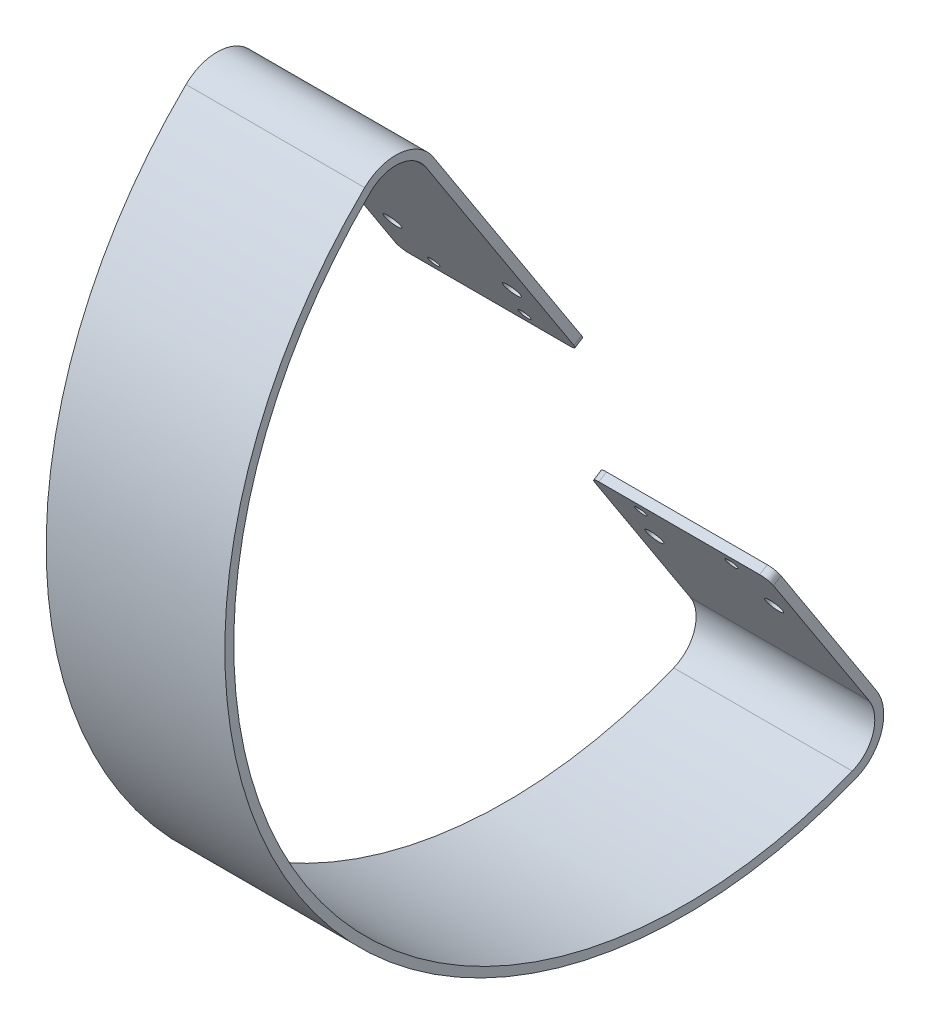
ISO-10303-21;
HEADER;
FILE_DESCRIPTION(('STEP AP214'),'2;1');
FILE_NAME('part.step','',(''),(''),'','','');
FILE_SCHEMA(('AUTOMOTIVE_DESIGN { 1 0 10303 214 1 1 1 1 }'));
ENDSEC;
DATA;
#1=APPLICATION_CONTEXT('core data for automotive mechanical design processes');
#2=APPLICATION_PROTOCOL_DEFINITION('international standard','automotive_design',2000,#1);
#3=PRODUCT_CONTEXT('',#1,'mechanical');
#4=PRODUCT('Part','Part','',(#3));
#5=PRODUCT_RELATED_PRODUCT_CATEGORY('part','',(#4));
#6=PRODUCT_DEFINITION_FORMATION('','',#4);
#7=PRODUCT_DEFINITION_CONTEXT('part definition',#1,'design');
#8=PRODUCT_DEFINITION('design','',#6,#7);
#9=PRODUCT_DEFINITION_SHAPE('','',#8);
#10=(LENGTH_UNIT() NAMED_UNIT(*) SI_UNIT(.MILLI.,.METRE.));
#11=(NAMED_UNIT(*) PLANE_ANGLE_UNIT() SI_UNIT($,.RADIAN.));
#12=(NAMED_UNIT(*) SI_UNIT($,.STERADIAN.) SOLID_ANGLE_UNIT());
#13=UNCERTAINTY_MEASURE_WITH_UNIT(LENGTH_MEASURE(1.E-05),#10,'distance_accuracy_value','');
#14=(GEOMETRIC_REPRESENTATION_CONTEXT(3) GLOBAL_UNCERTAINTY_ASSIGNED_CONTEXT((#13)) GLOBAL_UNIT_ASSIGNED_CONTEXT((#10,
#11,#12)) REPRESENTATION_CONTEXT('',''));
#15=CARTESIAN_POINT('',(0.,0.,0.));
#16=DIRECTION('',(0.,0.,1.));
#17=DIRECTION('',(1.,0.,0.));
#18=AXIS2_PLACEMENT_3D('',#15,#16,#17);
#19=CARTESIAN_POINT('',(2006.6,149.886108079532,-218.334745744563));
#20=DIRECTION('',(0.,0.543974891923004,-0.839101493835732));
#21=DIRECTION('',(0.,0.839101493835732,0.543974891923004));
#22=AXIS2_PLACEMENT_3D('',#19,#20,#21);
#23=PLANE('',#22);
#24=CARTESIAN_POINT('',(1967.84011050403,153.665323041059,-215.884746471111));
#25=DIRECTION('',(0.,0.543974891923004,-0.839101493835732));
#26=DIRECTION('',(1.,3.48262757274063E-13,2.25772683210182E-13));
#27=AXIS2_PLACEMENT_3D('',#24,#25,#26);
#28=ELLIPSE('',#27,1.5506422952547,1.55064227634246);
#29=CARTESIAN_POINT('',(1969.39075279928,153.665323041059,-215.884746471111));
#30=VERTEX_POINT('',#29);
#31=EDGE_CURVE('E202',#30,#30,#28,.T.);
#32=ORIENTED_EDGE('',*,*,#31,.T.);
#33=EDGE_LOOP('',(#32));
#34=FACE_BOUND('',#33,.T.);
#35=CARTESIAN_POINT('',(1997.90586178967,165.762560149689,-208.042318234388));
#36=DIRECTION('',(0.,0.543974891923004,-0.839101493835732));
#37=DIRECTION('',(1.,3.55764608070903E-13,2.30636002494456E-13));
#38=AXIS2_PLACEMENT_3D('',#35,#36,#37);
#39=ELLIPSE('',#38,2.38125000000022,2.38124997095735);
#40=CARTESIAN_POINT('',(2000.28711178967,165.762560149689,-208.042318234388));
#41=VERTEX_POINT('',#40);
#42=EDGE_CURVE('E478',#41,#41,#39,.T.);
#43=ORIENTED_EDGE('',*,*,#42,.T.);
#44=EDGE_LOOP('',(#43));
#45=FACE_BOUND('',#44,.T.);
#46=CARTESIAN_POINT('',(1963.90586178987,165.7624622721,-208.042381686725));
#47=DIRECTION('',(0.,0.543974891923004,-0.839101493835732));
#48=DIRECTION('',(1.,3.55764608070937E-13,2.30636002494477E-13));
#49=AXIS2_PLACEMENT_3D('',#46,#47,#48);
#50=ELLIPSE('',#49,2.38125,2.38124997095734);
#51=CARTESIAN_POINT('',(1966.28711178987,165.762462272101,-208.042381686724));
#52=VERTEX_POINT('',#51);
#53=EDGE_CURVE('E473',#52,#52,#50,.T.);
#54=ORIENTED_EDGE('',*,*,#53,.T.);
#55=EDGE_LOOP('',(#54));
#56=FACE_BOUND('',#55,.T.);
#57=CARTESIAN_POINT('',(1993.65591952053,153.665397358386,-215.884698292482));
#58=DIRECTION('',(0.,0.543974891923004,-0.839101493835732));
#59=DIRECTION('',(1.,3.54582697176244E-13,2.29869790235381E-13));
#60=AXIS2_PLACEMENT_3D('',#57,#58,#59);
#61=ELLIPSE('',#60,1.64615825234016,1.64615823226305);
#62=CARTESIAN_POINT('',(1995.30207777287,153.665397358386,-215.884698292481));
#63=VERTEX_POINT('',#62);
#64=EDGE_CURVE('E469',#63,#63,#61,.T.);
#65=ORIENTED_EDGE('',*,*,#64,.T.);
#66=EDGE_LOOP('',(#65));
#67=FACE_BOUND('',#66,.T.);
#68=DIRECTION('',(-1.,0.,0.));
#69=VECTOR('',#68,1.);
#70=CARTESIAN_POINT('',(2006.6,149.886108079532,-218.334745744563));
#71=LINE('',#70,#69);
#72=CARTESIAN_POINT('',(2004.06,149.886108079532,-218.334745744563));
#73=VERTEX_POINT('',#72);
#74=CARTESIAN_POINT('',(1958.34,149.886108079532,-218.334745744563));
#75=VERTEX_POINT('',#74);
#76=EDGE_CURVE('E247',#73,#75,#71,.T.);
#77=ORIENTED_EDGE('',*,*,#76,.F.);
#78=CARTESIAN_POINT('',(2004.06,152.017425873875,-216.953049519079));
#79=DIRECTION('',(0.,0.543974891923004,-0.839101493835732));
#80=DIRECTION('',(0.,0.839101493835732,0.543974891923004));
#81=AXIS2_PLACEMENT_3D('',#78,#79,#80);
#82=CIRCLE('',#81,2.54);
#83=CARTESIAN_POINT('',(2006.6,152.017425873875,-216.953049519079));
#84=VERTEX_POINT('',#83);
#85=EDGE_CURVE('E64',#73,#84,#82,.F.);
#86=ORIENTED_EDGE('',*,*,#85,.T.);
#87=DIRECTION('',(0.,-0.839101493835732,-0.543974891923004));
#88=VECTOR('',#87,1.);
#89=CARTESIAN_POINT('',(2006.6,149.886108079532,-218.334745744563));
#90=LINE('',#89,#88);
#91=CARTESIAN_POINT('',(2006.6,217.012893904773,-174.8176189933));
#92=VERTEX_POINT('',#91);
#93=EDGE_CURVE('E178',#92,#84,#90,.T.);
#94=ORIENTED_EDGE('',*,*,#93,.F.);
#95=DIRECTION('',(-1.,0.,0.));
#96=VECTOR('',#95,1.);
#97=CARTESIAN_POINT('',(2006.6,217.012893904773,-174.8176189933));
#98=LINE('',#97,#96);
#99=CARTESIAN_POINT('',(1955.8,217.012893904773,-174.8176189933));
#100=VERTEX_POINT('',#99);
#101=EDGE_CURVE('E199',#92,#100,#98,.T.);
#102=ORIENTED_EDGE('',*,*,#101,.T.);
#103=DIRECTION('',(0.,-0.839101493835732,-0.543974891923004));
#104=VECTOR('',#103,1.);
#105=CARTESIAN_POINT('',(1955.8,149.886108079532,-218.334745744563));
#106=LINE('',#105,#104);
#107=CARTESIAN_POINT('',(1955.8,152.017425873875,-216.953049519079));
#108=VERTEX_POINT('',#107);
#109=EDGE_CURVE('E200',#100,#108,#106,.T.);
#110=ORIENTED_EDGE('',*,*,#109,.T.);
#111=CARTESIAN_POINT('',(1958.34,152.017425873875,-216.953049519079));
#112=DIRECTION('',(0.,0.543974891923004,-0.839101493835732));
#113=DIRECTION('',(0.,0.839101493835732,0.543974891923004));
#114=AXIS2_PLACEMENT_3D('',#111,#112,#113);
#115=CIRCLE('',#114,2.54);
#116=EDGE_CURVE('E56',#108,#75,#115,.F.);
#117=ORIENTED_EDGE('',*,*,#116,.T.);
#118=EDGE_LOOP('',(#77,#86,#94,#102,#110,#117));
#119=FACE_BOUND('',#118,.T.);
#120=ADVANCED_FACE('F41',(#34,#45,#56,#67,#119),#23,.F.);
#121=CARTESIAN_POINT('',(2006.6,151.267804305016,-220.466063538906));
#122=DIRECTION('',(0.,-0.839101493835732,-0.543974891923003));
#123=DIRECTION('',(0.,0.543974891923004,-0.839101493835732));
#124=AXIS2_PLACEMENT_3D('',#121,#122,#123);
#125=PLANE('',#124);
#126=DIRECTION('',(-1.,0.,0.));
#127=VECTOR('',#126,1.);
#128=CARTESIAN_POINT('',(2006.6,151.267804305016,-220.466063538906));
#129=LINE('',#128,#127);
#130=CARTESIAN_POINT('',(2004.06,151.267804305016,-220.466063538906));
#131=VERTEX_POINT('',#130);
#132=CARTESIAN_POINT('',(1958.34,151.267804305016,-220.466063538906));
#133=VERTEX_POINT('',#132);
#134=EDGE_CURVE('E166',#131,#133,#129,.T.);
#135=ORIENTED_EDGE('',*,*,#134,.F.);
#136=DIRECTION('',(0.,-0.543974891923004,0.839101493835732));
#137=VECTOR('',#136,1.);
#138=CARTESIAN_POINT('',(2004.06,149.886108079532,-218.334745744563));
#139=LINE('',#138,#137);
#140=EDGE_CURVE('E273',#131,#73,#139,.T.);
#141=ORIENTED_EDGE('',*,*,#140,.T.);
#142=ORIENTED_EDGE('',*,*,#76,.T.);
#143=DIRECTION('',(0.,-0.543974891923004,0.839101493835732));
#144=VECTOR('',#143,1.);
#145=CARTESIAN_POINT('',(1958.34,151.267804305016,-220.466063538906));
#146=LINE('',#145,#144);
#147=EDGE_CURVE('E271',#75,#133,#146,.F.);
#148=ORIENTED_EDGE('',*,*,#147,.T.);
#149=EDGE_LOOP('',(#135,#141,#142,#148));
#150=FACE_BOUND('',#149,.T.);
#151=ADVANCED_FACE('F286',(#150),#125,.T.);
#152=CARTESIAN_POINT('',(2006.6,151.267804305016,-220.466063538906));
#153=DIRECTION('',(0.,0.543974891923003,-0.839101493835732));
#154=DIRECTION('',(0.,0.839101493835732,0.543974891923004));
#155=AXIS2_PLACEMENT_3D('',#152,#153,#154);
#156=PLANE('',#155);
#157=CARTESIAN_POINT('',(1967.84011050403,155.047019266543,-218.016064265454));
#158=DIRECTION('',(0.,0.543974891923004,-0.839101493835732));
#159=DIRECTION('',(1.,3.48262757274063E-13,2.25772683210182E-13));
#160=AXIS2_PLACEMENT_3D('',#157,#158,#159);
#161=ELLIPSE('',#160,1.5506422952547,1.55064227634246);
#162=CARTESIAN_POINT('',(1969.39075279928,155.047019266544,-218.016064265454));
#163=VERTEX_POINT('',#162);
#164=EDGE_CURVE('E374',#163,#163,#161,.T.);
#165=ORIENTED_EDGE('',*,*,#164,.F.);
#166=EDGE_LOOP('',(#165));
#167=FACE_BOUND('',#166,.T.);
#168=CARTESIAN_POINT('',(1997.90586178967,167.144256375173,-210.173636028731));
#169=DIRECTION('',(0.,0.543974891923004,-0.839101493835732));
#170=DIRECTION('',(1.,3.55764608070903E-13,2.30636002494456E-13));
#171=AXIS2_PLACEMENT_3D('',#168,#169,#170);
#172=ELLIPSE('',#171,2.38125000000022,2.38124997095735);
#173=CARTESIAN_POINT('',(2000.28711178967,167.144256375174,-210.17363602873));
#174=VERTEX_POINT('',#173);
#175=EDGE_CURVE('E378',#174,#174,#172,.T.);
#176=ORIENTED_EDGE('',*,*,#175,.F.);
#177=EDGE_LOOP('',(#176));
#178=FACE_BOUND('',#177,.T.);
#179=CARTESIAN_POINT('',(1963.90586178987,167.144158497585,-210.173699481068));
#180=DIRECTION('',(0.,0.543974891923004,-0.839101493835732));
#181=DIRECTION('',(1.,3.55764608070937E-13,2.30636002494477E-13));
#182=AXIS2_PLACEMENT_3D('',#179,#180,#181);
#183=ELLIPSE('',#182,2.38125,2.38124997095734);
#184=CARTESIAN_POINT('',(1966.28711178987,167.144158497585,-210.173699481067));
#185=VERTEX_POINT('',#184);
#186=EDGE_CURVE('E382',#185,#185,#183,.T.);
#187=ORIENTED_EDGE('',*,*,#186,.F.);
#188=EDGE_LOOP('',(#187));
#189=FACE_BOUND('',#188,.T.);
#190=CARTESIAN_POINT('',(1993.65591952053,155.04709358387,-218.016016086824));
#191=DIRECTION('',(0.,0.543974891923004,-0.839101493835732));
#192=DIRECTION('',(1.,3.54582697176244E-13,2.29869790235381E-13));
#193=AXIS2_PLACEMENT_3D('',#190,#191,#192);
#194=ELLIPSE('',#193,1.64615825234016,1.64615823226305);
#195=CARTESIAN_POINT('',(1995.30207777287,155.047093583871,-218.016016086824));
#196=VERTEX_POINT('',#195);
#197=EDGE_CURVE('E385',#196,#196,#194,.T.);
#198=ORIENTED_EDGE('',*,*,#197,.F.);
#199=EDGE_LOOP('',(#198));
#200=FACE_BOUND('',#199,.T.);
#201=DIRECTION('',(0.,-0.839101493835732,-0.543974891923004));
#202=VECTOR('',#201,1.);
#203=CARTESIAN_POINT('',(2006.6,151.267804305016,-220.466063538906));
#204=LINE('',#203,#202);
#205=CARTESIAN_POINT('',(2006.6,218.394590130257,-176.948936787643));
#206=VERTEX_POINT('',#205);
#207=CARTESIAN_POINT('',(2006.6,153.399122099359,-219.084367313422));
#208=VERTEX_POINT('',#207);
#209=EDGE_CURVE('E158',#206,#208,#204,.T.);
#210=ORIENTED_EDGE('',*,*,#209,.T.);
#211=CARTESIAN_POINT('',(2004.06,153.399122099359,-219.084367313422));
#212=DIRECTION('',(0.,0.543974891923003,-0.839101493835732));
#213=DIRECTION('',(0.,0.839101493835732,0.543974891923004));
#214=AXIS2_PLACEMENT_3D('',#211,#212,#213);
#215=CIRCLE('',#214,2.54);
#216=EDGE_CURVE('E11',#208,#131,#215,.T.);
#217=ORIENTED_EDGE('',*,*,#216,.T.);
#218=ORIENTED_EDGE('',*,*,#134,.T.);
#219=CARTESIAN_POINT('',(1958.34,153.399122099359,-219.084367313422));
#220=DIRECTION('',(0.,0.543974891923003,-0.839101493835732));
#221=DIRECTION('',(0.,0.839101493835732,0.543974891923004));
#222=AXIS2_PLACEMENT_3D('',#219,#220,#221);
#223=CIRCLE('',#222,2.54);
#224=CARTESIAN_POINT('',(1955.8,153.399122099359,-219.084367313422));
#225=VERTEX_POINT('',#224);
#226=EDGE_CURVE('E49',#133,#225,#223,.T.);
#227=ORIENTED_EDGE('',*,*,#226,.T.);
#228=DIRECTION('',(0.,-0.839101493835732,-0.543974891923004));
#229=VECTOR('',#228,1.);
#230=CARTESIAN_POINT('',(1955.8,151.267804305016,-220.466063538906));
#231=LINE('',#230,#229);
#232=CARTESIAN_POINT('',(1955.8,218.394590130257,-176.948936787643));
#233=VERTEX_POINT('',#232);
#234=EDGE_CURVE('E161',#233,#225,#231,.T.);
#235=ORIENTED_EDGE('',*,*,#234,.F.);
#236=DIRECTION('',(-1.,0.,0.));
#237=VECTOR('',#236,1.);
#238=CARTESIAN_POINT('',(2006.6,218.394590130257,-176.948936787643));
#239=LINE('',#238,#237);
#240=EDGE_CURVE('E155',#206,#233,#239,.T.);
#241=ORIENTED_EDGE('',*,*,#240,.F.);
#242=EDGE_LOOP('',(#210,#217,#218,#227,#235,#241));
#243=FACE_BOUND('',#242,.T.);
#244=ADVANCED_FACE('F157',(#167,#178,#189,#200,#243),#156,.T.);
#245=CARTESIAN_POINT('',(2006.6,211.486109002835,-166.292347815929));
#246=DIRECTION('',(-1.,0.,0.));
#247=DIRECTION('',(0.,0.,1.));
#248=AXIS2_PLACEMENT_3D('',#245,#246,#247);
#249=CYLINDRICAL_SURFACE('',#248,12.7);
#250=CARTESIAN_POINT('',(1955.8,211.486109002835,-166.292347815929));
#251=DIRECTION('',(-1.,0.,0.));
#252=DIRECTION('',(0.,0.,-1.));
#253=AXIS2_PLACEMENT_3D('',#250,#251,#252);
#254=CIRCLE('',#253,12.7);
#255=CARTESIAN_POINT('',(1955.8,220.604709470289,-157.452600901286));
#256=VERTEX_POINT('',#255);
#257=EDGE_CURVE('E204',#256,#233,#254,.T.);
#258=ORIENTED_EDGE('',*,*,#257,.F.);
#259=DIRECTION('',(-1.,0.,0.));
#260=VECTOR('',#259,1.);
#261=CARTESIAN_POINT('',(2006.6,220.604709470289,-157.452600901286));
#262=LINE('',#261,#260);
#263=CARTESIAN_POINT('',(2006.6,220.604709470289,-157.452600901286));
#264=VERTEX_POINT('',#263);
#265=EDGE_CURVE('E167',#264,#256,#262,.T.);
#266=ORIENTED_EDGE('',*,*,#265,.F.);
#267=CARTESIAN_POINT('',(2006.6,211.486109002835,-166.292347815929));
#268=DIRECTION('',(-1.,0.,0.));
#269=DIRECTION('',(0.,0.,-1.));
#270=AXIS2_PLACEMENT_3D('',#267,#268,#269);
#271=CIRCLE('',#270,12.7);
#272=EDGE_CURVE('E174',#264,#206,#271,.T.);
#273=ORIENTED_EDGE('',*,*,#272,.T.);
#274=ORIENTED_EDGE('',*,*,#240,.T.);
#275=EDGE_LOOP('',(#258,#266,#273,#274));
#276=FACE_BOUND('',#275,.T.);
#277=ADVANCED_FACE('F180',(#276),#249,.T.);
#278=CARTESIAN_POINT('',(2006.6,126.694324041268,-248.49113722186));
#279=DIRECTION('',(-1.,0.,0.));
#280=DIRECTION('',(0.,0.,1.));
#281=AXIS2_PLACEMENT_3D('',#278,#279,#280);
#282=CYLINDRICAL_SURFACE('',#281,130.794401970496);
#283=CARTESIAN_POINT('',(1955.8,126.694324041268,-248.49113722186));
#284=DIRECTION('',(-1.,0.,0.));
#285=DIRECTION('',(0.,0.,-1.));
#286=AXIS2_PLACEMENT_3D('',#283,#284,#285);
#287=CIRCLE('',#286,130.794401970496);
#288=CARTESIAN_POINT('',(1955.8,5.25262946196778,-297.061605662341));
#289=VERTEX_POINT('',#288);
#290=EDGE_CURVE('E206',#289,#256,#287,.T.);
#291=ORIENTED_EDGE('',*,*,#290,.F.);
#292=DIRECTION('',(-1.,0.,0.));
#293=VECTOR('',#292,1.);
#294=CARTESIAN_POINT('',(2006.6,5.25262946196778,-297.061605662341));
#295=LINE('',#294,#293);
#296=CARTESIAN_POINT('',(2006.6,5.25262946196778,-297.061605662341));
#297=VERTEX_POINT('',#296);
#298=EDGE_CURVE('E242',#297,#289,#295,.T.);
#299=ORIENTED_EDGE('',*,*,#298,.F.);
#300=CARTESIAN_POINT('',(2006.6,126.694324041268,-248.49113722186));
#301=DIRECTION('',(-1.,0.,0.));
#302=DIRECTION('',(0.,0.,-1.));
#303=AXIS2_PLACEMENT_3D('',#300,#301,#302);
#304=CIRCLE('',#303,130.794401970496);
#305=EDGE_CURVE('E181',#297,#264,#304,.T.);
#306=ORIENTED_EDGE('',*,*,#305,.T.);
#307=ORIENTED_EDGE('',*,*,#265,.T.);
#308=EDGE_LOOP('',(#291,#299,#306,#307));
#309=FACE_BOUND('',#308,.T.);
#310=ADVANCED_FACE('F356',(#309),#282,.T.);
#311=CARTESIAN_POINT('',(2006.6,17.0444913300699,-292.345463840512));
#312=DIRECTION('',(-1.,0.,0.));
#313=DIRECTION('',(0.,0.,1.));
#314=AXIS2_PLACEMENT_3D('',#311,#312,#313);
#315=CYLINDRICAL_SURFACE('',#314,12.7);
#316=CARTESIAN_POINT('',(1955.8,17.0444913300699,-292.345463840512));
#317=DIRECTION('',(-1.,0.,0.));
#318=DIRECTION('',(0.,0.,-1.));
#319=AXIS2_PLACEMENT_3D('',#316,#317,#318);
#320=CIRCLE('',#319,12.7);
#321=CARTESIAN_POINT('',(1955.8,23.9529724574921,-303.002052812226));
#322=VERTEX_POINT('',#321);
#323=EDGE_CURVE('E209',#322,#289,#320,.T.);
#324=ORIENTED_EDGE('',*,*,#323,.F.);
#325=DIRECTION('',(-1.,0.,0.));
#326=VECTOR('',#325,1.);
#327=CARTESIAN_POINT('',(2006.6,23.9529724574921,-303.002052812226));
#328=LINE('',#327,#326);
#329=CARTESIAN_POINT('',(2006.6,23.9529724574921,-303.002052812226));
#330=VERTEX_POINT('',#329);
#331=EDGE_CURVE('E239',#330,#322,#328,.T.);
#332=ORIENTED_EDGE('',*,*,#331,.F.);
#333=CARTESIAN_POINT('',(2006.6,17.0444913300699,-292.345463840512));
#334=DIRECTION('',(-1.,0.,0.));
#335=DIRECTION('',(0.,0.,-1.));
#336=AXIS2_PLACEMENT_3D('',#333,#334,#335);
#337=CIRCLE('',#336,12.7);
#338=EDGE_CURVE('E183',#330,#297,#337,.T.);
#339=ORIENTED_EDGE('',*,*,#338,.T.);
#340=ORIENTED_EDGE('',*,*,#298,.T.);
#341=EDGE_LOOP('',(#324,#332,#339,#340));
#342=FACE_BOUND('',#341,.T.);
#343=ADVANCED_FACE('F353',(#342),#315,.T.);
#344=CARTESIAN_POINT('',(2006.6,67.9873895182371,-274.455306754114));
#345=DIRECTION('',(0.,0.543974891923004,-0.839101493835731));
#346=DIRECTION('',(0.,0.839101493835732,0.543974891923004));
#347=AXIS2_PLACEMENT_3D('',#344,#345,#346);
#348=PLANE('',#347);
#349=CARTESIAN_POINT('',(1993.65629061313,64.2844925671254,-276.855830389908));
#350=DIRECTION('',(0.,0.543974891923004,-0.839101493835732));
#351=DIRECTION('',(-1.,-3.53698451048622E-13,-2.29296548863223E-13));
#352=AXIS2_PLACEMENT_3D('',#349,#350,#351);
#353=ELLIPSE('',#352,1.64615825234016,1.64615823226305);
#354=CARTESIAN_POINT('',(1992.01013236079,64.2844925671248,-276.855830389908));
#355=VERTEX_POINT('',#354);
#356=EDGE_CURVE('E388',#355,#355,#353,.T.);
#357=ORIENTED_EDGE('',*,*,#356,.F.);
#358=EDGE_LOOP('',(#357));
#359=FACE_BOUND('',#358,.T.);
#360=CARTESIAN_POINT('',(1963.90633180346,52.1872552448253,-284.69825876515));
#361=DIRECTION('',(0.,0.543974891923004,-0.839101493835732));
#362=DIRECTION('',(1.,3.56987166861558E-13,2.31428566076933E-13));
#363=AXIS2_PLACEMENT_3D('',#360,#361,#362);
#364=ELLIPSE('',#363,2.38125,2.38124997095734);
#365=CARTESIAN_POINT('',(1966.28758180346,52.1872552448262,-284.698258765149));
#366=VERTEX_POINT('',#365);
#367=EDGE_CURVE('E428',#366,#366,#364,.T.);
#368=ORIENTED_EDGE('',*,*,#367,.F.);
#369=EDGE_LOOP('',(#368));
#370=FACE_BOUND('',#369,.T.);
#371=CARTESIAN_POINT('',(1967.84048159663,64.2844182497981,-276.855878568538));
#372=DIRECTION('',(0.,0.543974891923004,-0.839101493835732));
#373=DIRECTION('',(-1.,-3.45446616379663E-13,-2.23947028089885E-13));
#374=AXIS2_PLACEMENT_3D('',#371,#372,#373);
#375=ELLIPSE('',#374,1.5506422952547,1.55064227634247);
#376=CARTESIAN_POINT('',(1966.28983930138,64.2844182497975,-276.855878568538));
#377=VERTEX_POINT('',#376);
#378=EDGE_CURVE('E411',#377,#377,#375,.T.);
#379=ORIENTED_EDGE('',*,*,#378,.F.);
#380=EDGE_LOOP('',(#379));
#381=FACE_BOUND('',#380,.T.);
#382=CARTESIAN_POINT('',(1997.90633180326,52.1873531224137,-284.698195312813));
#383=DIRECTION('',(0.,0.543974891923004,-0.839101493835732));
#384=DIRECTION('',(1.,3.56987166861525E-13,2.31428566076911E-13));
#385=AXIS2_PLACEMENT_3D('',#382,#383,#384);
#386=ELLIPSE('',#385,2.38125000000022,2.38124997095734);
#387=CARTESIAN_POINT('',(2000.28758180326,52.1873531224145,-284.698195312813));
#388=VERTEX_POINT('',#387);
#389=EDGE_CURVE('E430',#388,#388,#386,.T.);
#390=ORIENTED_EDGE('',*,*,#389,.F.);
#391=EDGE_LOOP('',(#390));
#392=FACE_BOUND('',#391,.T.);
#393=DIRECTION('',(-1.,0.,0.));
#394=VECTOR('',#393,1.);
#395=CARTESIAN_POINT('',(2006.6,67.9873895182371,-274.455306754114));
#396=LINE('',#395,#394);
#397=CARTESIAN_POINT('',(2004.06,67.9873895182371,-274.455306754114));
#398=VERTEX_POINT('',#397);
#399=CARTESIAN_POINT('',(1958.34,67.9873895182371,-274.455306754114));
#400=VERTEX_POINT('',#399);
#401=EDGE_CURVE('E236',#398,#400,#396,.T.);
#402=ORIENTED_EDGE('',*,*,#401,.F.);
#403=CARTESIAN_POINT('',(2004.06,65.8560717238944,-275.837002979598));
#404=DIRECTION('',(0.,0.543974891923004,-0.839101493835731));
#405=DIRECTION('',(0.,0.839101493835732,0.543974891923004));
#406=AXIS2_PLACEMENT_3D('',#403,#404,#405);
#407=CIRCLE('',#406,2.54);
#408=CARTESIAN_POINT('',(2006.6,65.8560717238944,-275.837002979598));
#409=VERTEX_POINT('',#408);
#410=EDGE_CURVE('E256',#398,#409,#407,.T.);
#411=ORIENTED_EDGE('',*,*,#410,.T.);
#412=DIRECTION('',(0.,-0.839101493835732,-0.543974891923004));
#413=VECTOR('',#412,1.);
#414=CARTESIAN_POINT('',(2006.6,67.9873895182371,-274.455306754114));
#415=LINE('',#414,#413);
#416=EDGE_CURVE('E189',#409,#330,#415,.T.);
#417=ORIENTED_EDGE('',*,*,#416,.T.);
#418=ORIENTED_EDGE('',*,*,#331,.T.);
#419=DIRECTION('',(0.,-0.839101493835732,-0.543974891923004));
#420=VECTOR('',#419,1.);
#421=CARTESIAN_POINT('',(1955.8,67.9873895182371,-274.455306754114));
#422=LINE('',#421,#420);
#423=CARTESIAN_POINT('',(1955.8,65.8560717238944,-275.837002979598));
#424=VERTEX_POINT('',#423);
#425=EDGE_CURVE('E212',#424,#322,#422,.T.);
#426=ORIENTED_EDGE('',*,*,#425,.F.);
#427=CARTESIAN_POINT('',(1958.34,65.8560717238944,-275.837002979598));
#428=DIRECTION('',(0.,0.543974891923004,-0.839101493835731));
#429=DIRECTION('',(0.,0.839101493835732,0.543974891923004));
#430=AXIS2_PLACEMENT_3D('',#427,#428,#429);
#431=CIRCLE('',#430,2.54);
#432=EDGE_CURVE('E254',#424,#400,#431,.T.);
#433=ORIENTED_EDGE('',*,*,#432,.T.);
#434=EDGE_LOOP('',(#402,#411,#417,#418,#426,#433));
#435=FACE_BOUND('',#434,.T.);
#436=ADVANCED_FACE('F350',(#359,#370,#381,#392,#435),#348,.T.);
#437=CARTESIAN_POINT('',(2006.6,66.6056932927527,-272.323988959771));
#438=DIRECTION('',(0.,0.839101493835735,0.543974891922999));
#439=DIRECTION('',(0.,-0.543974891922999,0.839101493835735));
#440=AXIS2_PLACEMENT_3D('',#437,#438,#439);
#441=PLANE('',#440);
#442=DIRECTION('',(-1.,0.,0.));
#443=VECTOR('',#442,1.);
#444=CARTESIAN_POINT('',(2006.6,66.6056932927527,-272.323988959771));
#445=LINE('',#444,#443);
#446=CARTESIAN_POINT('',(2004.06,66.6056932927527,-272.323988959771));
#447=VERTEX_POINT('',#446);
#448=CARTESIAN_POINT('',(1958.34,66.6056932927527,-272.323988959771));
#449=VERTEX_POINT('',#448);
#450=EDGE_CURVE('E233',#447,#449,#445,.T.);
#451=ORIENTED_EDGE('',*,*,#450,.F.);
#452=DIRECTION('',(0.,0.543974891922999,-0.839101493835735));
#453=VECTOR('',#452,1.);
#454=CARTESIAN_POINT('',(2004.06,67.9873895182371,-274.455306754114));
#455=LINE('',#454,#453);
#456=EDGE_CURVE('E251',#447,#398,#455,.T.);
#457=ORIENTED_EDGE('',*,*,#456,.T.);
#458=ORIENTED_EDGE('',*,*,#401,.T.);
#459=DIRECTION('',(0.,0.543974891922999,-0.839101493835735));
#460=VECTOR('',#459,1.);
#461=CARTESIAN_POINT('',(1958.34,66.6056932927527,-272.323988959771));
#462=LINE('',#461,#460);
#463=EDGE_CURVE('E249',#400,#449,#462,.F.);
#464=ORIENTED_EDGE('',*,*,#463,.T.);
#465=EDGE_LOOP('',(#451,#457,#458,#464));
#466=FACE_BOUND('',#465,.T.);
#467=ADVANCED_FACE('F331',(#466),#441,.T.);
#468=CARTESIAN_POINT('',(2006.6,66.6056932927527,-272.323988959771));
#469=DIRECTION('',(0.,0.543974891923004,-0.839101493835731));
#470=DIRECTION('',(0.,0.839101493835732,0.543974891923004));
#471=AXIS2_PLACEMENT_3D('',#468,#469,#470);
#472=PLANE('',#471);
#473=CARTESIAN_POINT('',(1993.65629061313,62.9027963416409,-274.724512595565));
#474=DIRECTION('',(0.,0.543974891923004,-0.839101493835732));
#475=DIRECTION('',(-1.,-3.53698451048622E-13,-2.29296548863223E-13));
#476=AXIS2_PLACEMENT_3D('',#473,#474,#475);
#477=ELLIPSE('',#476,1.64615825234016,1.64615823226305);
#478=CARTESIAN_POINT('',(1992.01013236079,62.9027963416403,-274.724512595566));
#479=VERTEX_POINT('',#478);
#480=EDGE_CURVE('E487',#479,#479,#477,.T.);
#481=ORIENTED_EDGE('',*,*,#480,.T.);
#482=EDGE_LOOP('',(#481));
#483=FACE_BOUND('',#482,.T.);
#484=CARTESIAN_POINT('',(1963.90633180346,50.8055590193408,-282.566940970807));
#485=DIRECTION('',(0.,0.543974891923004,-0.839101493835732));
#486=DIRECTION('',(1.,3.56987166861558E-13,2.31428566076933E-13));
#487=AXIS2_PLACEMENT_3D('',#484,#485,#486);
#488=ELLIPSE('',#487,2.38125,2.38124997095734);
#489=CARTESIAN_POINT('',(1966.28758180346,50.8055590193416,-282.566940970806));
#490=VERTEX_POINT('',#489);
#491=EDGE_CURVE('E484',#490,#490,#488,.T.);
#492=ORIENTED_EDGE('',*,*,#491,.T.);
#493=EDGE_LOOP('',(#492));
#494=FACE_BOUND('',#493,.T.);
#495=CARTESIAN_POINT('',(1967.84048159663,62.9027220243136,-274.724560774195));
#496=DIRECTION('',(0.,0.543974891923004,-0.839101493835732));
#497=DIRECTION('',(-1.,-3.45446616379663E-13,-2.23947028089885E-13));
#498=AXIS2_PLACEMENT_3D('',#495,#496,#497);
#499=ELLIPSE('',#498,1.5506422952547,1.55064227634247);
#500=CARTESIAN_POINT('',(1966.28983930138,62.902722024313,-274.724560774195));
#501=VERTEX_POINT('',#500);
#502=EDGE_CURVE('E481',#501,#501,#499,.T.);
#503=ORIENTED_EDGE('',*,*,#502,.T.);
#504=EDGE_LOOP('',(#503));
#505=FACE_BOUND('',#504,.T.);
#506=CARTESIAN_POINT('',(1997.90633180326,50.8056568969292,-282.56687751847));
#507=DIRECTION('',(0.,0.543974891923004,-0.839101493835732));
#508=DIRECTION('',(1.,3.56987166861525E-13,2.31428566076911E-13));
#509=AXIS2_PLACEMENT_3D('',#506,#507,#508);
#510=ELLIPSE('',#509,2.38125000000022,2.38124997095734);
#511=CARTESIAN_POINT('',(2000.28758180326,50.8056568969301,-282.56687751847));
#512=VERTEX_POINT('',#511);
#513=EDGE_CURVE('E467',#512,#512,#510,.T.);
#514=ORIENTED_EDGE('',*,*,#513,.T.);
#515=EDGE_LOOP('',(#514));
#516=FACE_BOUND('',#515,.T.);
#517=DIRECTION('',(0.,-0.839101493835732,-0.543974891923004));
#518=VECTOR('',#517,1.);
#519=CARTESIAN_POINT('',(2006.6,66.6056932927527,-272.323988959771));
#520=LINE('',#519,#518);
#521=CARTESIAN_POINT('',(2006.6,64.47437549841,-273.705685185255));
#522=VERTEX_POINT('',#521);
#523=CARTESIAN_POINT('',(2006.6,22.5712762320076,-300.870735017883));
#524=VERTEX_POINT('',#523);
#525=EDGE_CURVE('E191',#522,#524,#520,.T.);
#526=ORIENTED_EDGE('',*,*,#525,.F.);
#527=CARTESIAN_POINT('',(2004.06,64.4743754984099,-273.705685185255));
#528=DIRECTION('',(0.,0.543974891923004,-0.839101493835731));
#529=DIRECTION('',(0.,0.839101493835732,0.543974891923004));
#530=AXIS2_PLACEMENT_3D('',#527,#528,#529);
#531=CIRCLE('',#530,2.54);
#532=EDGE_CURVE('E263',#522,#447,#531,.F.);
#533=ORIENTED_EDGE('',*,*,#532,.T.);
#534=ORIENTED_EDGE('',*,*,#450,.T.);
#535=CARTESIAN_POINT('',(1958.34,64.47437549841,-273.705685185255));
#536=DIRECTION('',(0.,0.543974891923004,-0.839101493835731));
#537=DIRECTION('',(0.,0.839101493835732,0.543974891923004));
#538=AXIS2_PLACEMENT_3D('',#535,#536,#537);
#539=CIRCLE('',#538,2.54);
#540=CARTESIAN_POINT('',(1955.8,64.47437549841,-273.705685185255));
#541=VERTEX_POINT('',#540);
#542=EDGE_CURVE('E261',#449,#541,#539,.F.);
#543=ORIENTED_EDGE('',*,*,#542,.T.);
#544=DIRECTION('',(0.,-0.839101493835732,-0.543974891923004));
#545=VECTOR('',#544,1.);
#546=CARTESIAN_POINT('',(1955.8,66.6056932927527,-272.323988959771));
#547=LINE('',#546,#545);
#548=CARTESIAN_POINT('',(1955.8,22.5712762320076,-300.870735017883));
#549=VERTEX_POINT('',#548);
#550=EDGE_CURVE('E214',#541,#549,#547,.T.);
#551=ORIENTED_EDGE('',*,*,#550,.T.);
#552=DIRECTION('',(-1.,0.,0.));
#553=VECTOR('',#552,1.);
#554=CARTESIAN_POINT('',(2006.6,22.5712762320076,-300.870735017883));
#555=LINE('',#554,#553);
#556=EDGE_CURVE('E230',#524,#549,#555,.T.);
#557=ORIENTED_EDGE('',*,*,#556,.F.);
#558=EDGE_LOOP('',(#526,#533,#534,#543,#551,#557));
#559=FACE_BOUND('',#558,.T.);
#560=ADVANCED_FACE('F327',(#483,#494,#505,#516,#559),#472,.F.);
#561=CARTESIAN_POINT('',(2006.6,17.0444913300699,-292.345463840512));
#562=DIRECTION('',(-1.,0.,0.));
#563=DIRECTION('',(0.,0.,1.));
#564=AXIS2_PLACEMENT_3D('',#561,#562,#563);
#565=CYLINDRICAL_SURFACE('',#564,10.16);
#566=CARTESIAN_POINT('',(1955.8,17.0444913300699,-292.345463840512));
#567=DIRECTION('',(1.,0.,0.));
#568=DIRECTION('',(0.,0.,-1.));
#569=AXIS2_PLACEMENT_3D('',#566,#567,#568);
#570=CIRCLE('',#569,10.16);
#571=CARTESIAN_POINT('',(1955.8,7.61100183558819,-296.118377297975));
#572=VERTEX_POINT('',#571);
#573=EDGE_CURVE('E216',#549,#572,#570,.F.);
#574=ORIENTED_EDGE('',*,*,#573,.T.);
#575=DIRECTION('',(-1.,0.,0.));
#576=VECTOR('',#575,1.);
#577=CARTESIAN_POINT('',(2006.6,7.61100183558819,-296.118377297975));
#578=LINE('',#577,#576);
#579=CARTESIAN_POINT('',(2006.6,7.61100183558819,-296.118377297975));
#580=VERTEX_POINT('',#579);
#581=EDGE_CURVE('E227',#580,#572,#578,.T.);
#582=ORIENTED_EDGE('',*,*,#581,.F.);
#583=CARTESIAN_POINT('',(2006.6,17.0444913300699,-292.345463840512));
#584=DIRECTION('',(1.,0.,0.));
#585=DIRECTION('',(0.,0.,-1.));
#586=AXIS2_PLACEMENT_3D('',#583,#584,#585);
#587=CIRCLE('',#586,10.16);
#588=EDGE_CURVE('E193',#524,#580,#587,.F.);
#589=ORIENTED_EDGE('',*,*,#588,.F.);
#590=ORIENTED_EDGE('',*,*,#556,.T.);
#591=EDGE_LOOP('',(#574,#582,#589,#590));
#592=FACE_BOUND('',#591,.T.);
#593=ADVANCED_FACE('F341',(#592),#565,.F.);
#594=CARTESIAN_POINT('',(2006.6,126.694324041268,-248.49113722186));
#595=DIRECTION('',(-1.,0.,0.));
#596=DIRECTION('',(0.,0.,1.));
#597=AXIS2_PLACEMENT_3D('',#594,#595,#596);
#598=CYLINDRICAL_SURFACE('',#597,128.254401970496);
#599=CARTESIAN_POINT('',(1955.8,126.694324041268,-248.49113722186));
#600=DIRECTION('',(1.,0.,0.));
#601=DIRECTION('',(0.,0.,-1.));
#602=AXIS2_PLACEMENT_3D('',#599,#600,#601);
#603=CIRCLE('',#602,128.254401970496);
#604=CARTESIAN_POINT('',(1955.8,218.780989376798,-159.220550284215));
#605=VERTEX_POINT('',#604);
#606=EDGE_CURVE('E218',#572,#605,#603,.F.);
#607=ORIENTED_EDGE('',*,*,#606,.T.);
#608=DIRECTION('',(-1.,0.,0.));
#609=VECTOR('',#608,1.);
#610=CARTESIAN_POINT('',(2006.6,218.780989376798,-159.220550284215));
#611=LINE('',#610,#609);
#612=CARTESIAN_POINT('',(2006.6,218.780989376798,-159.220550284215));
#613=VERTEX_POINT('',#612);
#614=EDGE_CURVE('E224',#613,#605,#611,.T.);
#615=ORIENTED_EDGE('',*,*,#614,.F.);
#616=CARTESIAN_POINT('',(2006.6,126.694324041268,-248.49113722186));
#617=DIRECTION('',(1.,0.,0.));
#618=DIRECTION('',(0.,0.,-1.));
#619=AXIS2_PLACEMENT_3D('',#616,#617,#618);
#620=CIRCLE('',#619,128.254401970496);
#621=EDGE_CURVE('E195',#580,#613,#620,.F.);
#622=ORIENTED_EDGE('',*,*,#621,.F.);
#623=ORIENTED_EDGE('',*,*,#581,.T.);
#624=EDGE_LOOP('',(#607,#615,#622,#623));
#625=FACE_BOUND('',#624,.T.);
#626=ADVANCED_FACE('F345',(#625),#598,.F.);
#627=CARTESIAN_POINT('',(2006.6,211.486109002835,-166.292347815929));
#628=DIRECTION('',(-1.,0.,0.));
#629=DIRECTION('',(0.,0.,1.));
#630=AXIS2_PLACEMENT_3D('',#627,#628,#629);
#631=CYLINDRICAL_SURFACE('',#630,10.16);
#632=CARTESIAN_POINT('',(1955.8,211.486109002835,-166.292347815929));
#633=DIRECTION('',(1.,0.,0.));
#634=DIRECTION('',(0.,0.,-1.));
#635=AXIS2_PLACEMENT_3D('',#632,#633,#634);
#636=CIRCLE('',#635,10.16);
#637=EDGE_CURVE('E220',#605,#100,#636,.F.);
#638=ORIENTED_EDGE('',*,*,#637,.T.);
#639=ORIENTED_EDGE('',*,*,#101,.F.);
#640=CARTESIAN_POINT('',(2006.6,211.486109002835,-166.292347815929));
#641=DIRECTION('',(1.,0.,0.));
#642=DIRECTION('',(0.,0.,-1.));
#643=AXIS2_PLACEMENT_3D('',#640,#641,#642);
#644=CIRCLE('',#643,10.16);
#645=EDGE_CURVE('E197',#613,#92,#644,.F.);
#646=ORIENTED_EDGE('',*,*,#645,.F.);
#647=ORIENTED_EDGE('',*,*,#614,.T.);
#648=EDGE_LOOP('',(#638,#639,#646,#647));
#649=FACE_BOUND('',#648,.T.);
#650=ADVANCED_FACE('F441',(#649),#631,.F.);
#651=CARTESIAN_POINT('',(2006.6,211.486109002835,-166.292347815929));
#652=DIRECTION('',(-1.,0.,0.));
#653=DIRECTION('',(0.,0.,1.));
#654=AXIS2_PLACEMENT_3D('',#651,#652,#653);
#655=PLANE('',#654);
#656=ORIENTED_EDGE('',*,*,#416,.F.);
#657=DIRECTION('',(0.,0.543974891922999,-0.839101493835735));
#658=VECTOR('',#657,1.);
#659=CARTESIAN_POINT('',(2006.6,64.4743754984099,-273.705685185255));
#660=LINE('',#659,#658);
#661=EDGE_CURVE('E259',#409,#522,#660,.F.);
#662=ORIENTED_EDGE('',*,*,#661,.T.);
#663=ORIENTED_EDGE('',*,*,#525,.T.);
#664=ORIENTED_EDGE('',*,*,#588,.T.);
#665=ORIENTED_EDGE('',*,*,#621,.T.);
#666=ORIENTED_EDGE('',*,*,#645,.T.);
#667=ORIENTED_EDGE('',*,*,#93,.T.);
#668=DIRECTION('',(0.,-0.543974891923004,0.839101493835732));
#669=VECTOR('',#668,1.);
#670=CARTESIAN_POINT('',(2006.6,153.399122099359,-219.084367313422));
#671=LINE('',#670,#669);
#672=EDGE_CURVE('E177',#84,#208,#671,.F.);
#673=ORIENTED_EDGE('',*,*,#672,.T.);
#674=ORIENTED_EDGE('',*,*,#209,.F.);
#675=ORIENTED_EDGE('',*,*,#272,.F.);
#676=ORIENTED_EDGE('',*,*,#305,.F.);
#677=ORIENTED_EDGE('',*,*,#338,.F.);
#678=EDGE_LOOP('',(#656,#662,#663,#664,#665,#666,#667,#673,#674,#675,#676,#677));
#679=FACE_BOUND('',#678,.T.);
#680=ADVANCED_FACE('F172',(#679),#655,.F.);
#681=CARTESIAN_POINT('',(1955.8,211.486109002835,-166.292347815929));
#682=DIRECTION('',(-1.,0.,0.));
#683=DIRECTION('',(0.,0.,1.));
#684=AXIS2_PLACEMENT_3D('',#681,#682,#683);
#685=PLANE('',#684);
#686=ORIENTED_EDGE('',*,*,#550,.F.);
#687=DIRECTION('',(0.,0.543974891922999,-0.839101493835735));
#688=VECTOR('',#687,1.);
#689=CARTESIAN_POINT('',(1955.8,58.9475905964718,-265.180414007883));
#690=LINE('',#689,#688);
#691=EDGE_CURVE('E268',#541,#424,#690,.T.);
#692=ORIENTED_EDGE('',*,*,#691,.T.);
#693=ORIENTED_EDGE('',*,*,#425,.T.);
#694=ORIENTED_EDGE('',*,*,#323,.T.);
#695=ORIENTED_EDGE('',*,*,#290,.T.);
#696=ORIENTED_EDGE('',*,*,#257,.T.);
#697=ORIENTED_EDGE('',*,*,#234,.T.);
#698=DIRECTION('',(0.,-0.543974891923004,0.839101493835732));
#699=VECTOR('',#698,1.);
#700=CARTESIAN_POINT('',(1955.8,146.490640971937,-208.427778341708));
#701=LINE('',#700,#699);
#702=EDGE_CURVE('E265',#225,#108,#701,.T.);
#703=ORIENTED_EDGE('',*,*,#702,.T.);
#704=ORIENTED_EDGE('',*,*,#109,.F.);
#705=ORIENTED_EDGE('',*,*,#637,.F.);
#706=ORIENTED_EDGE('',*,*,#606,.F.);
#707=ORIENTED_EDGE('',*,*,#573,.F.);
#708=EDGE_LOOP('',(#686,#692,#693,#694,#695,#696,#697,#703,#704,#705,#706,#707));
#709=FACE_BOUND('',#708,.T.);
#710=ADVANCED_FACE('F283',(#709),#685,.T.);
#711=CARTESIAN_POINT('',(1997.90633180326,-40.697179394446,-141.420350790235));
#712=DIRECTION('',(0.,0.543974891923004,-0.839101493835732));
#713=DIRECTION('',(1.,3.56987166861525E-13,2.31428566076911E-13));
#714=AXIS2_PLACEMENT_3D('',#711,#712,#713);
#715=ELLIPSE('',#714,2.38125000000022,2.38124997095734);
#716=DIRECTION('',(0.,0.543974891923004,-0.839101493835732));
#717=VECTOR('',#716,1.);
#718=SURFACE_OF_LINEAR_EXTRUSION('',#715,#717);
#719=ORIENTED_EDGE('',*,*,#389,.T.);
#720=EDGE_LOOP('',(#719));
#721=FACE_BOUND('',#720,.T.);
#722=ORIENTED_EDGE('',*,*,#513,.F.);
#723=EDGE_LOOP('',(#722));
#724=FACE_BOUND('',#723,.T.);
#725=ADVANCED_FACE('F422',(#721,#724),#718,.F.);
#726=CARTESIAN_POINT('',(1967.84048159663,-28.6001142670616,-133.578034045959));
#727=DIRECTION('',(0.,0.543974891923004,-0.839101493835732));
#728=DIRECTION('',(-1.,-3.45446616379663E-13,-2.23947028089885E-13));
#729=AXIS2_PLACEMENT_3D('',#726,#727,#728);
#730=ELLIPSE('',#729,1.5506422952547,1.55064227634247);
#731=DIRECTION('',(0.,0.543974891923004,-0.839101493835732));
#732=VECTOR('',#731,1.);
#733=SURFACE_OF_LINEAR_EXTRUSION('',#730,#732);
#734=ORIENTED_EDGE('',*,*,#378,.T.);
#735=EDGE_LOOP('',(#734));
#736=FACE_BOUND('',#735,.T.);
#737=ORIENTED_EDGE('',*,*,#502,.F.);
#738=EDGE_LOOP('',(#737));
#739=FACE_BOUND('',#738,.T.);
#740=ADVANCED_FACE('F418',(#736,#739),#733,.F.);
#741=CARTESIAN_POINT('',(1963.90633180346,-40.6972772720344,-141.420414242571));
#742=DIRECTION('',(0.,0.543974891923004,-0.839101493835732));
#743=DIRECTION('',(1.,3.56987166861558E-13,2.31428566076933E-13));
#744=AXIS2_PLACEMENT_3D('',#741,#742,#743);
#745=ELLIPSE('',#744,2.38125,2.38124997095734);
#746=DIRECTION('',(0.,0.543974891923004,-0.839101493835732));
#747=VECTOR('',#746,1.);
#748=SURFACE_OF_LINEAR_EXTRUSION('',#745,#747);
#749=ORIENTED_EDGE('',*,*,#367,.T.);
#750=EDGE_LOOP('',(#749));
#751=FACE_BOUND('',#750,.T.);
#752=ORIENTED_EDGE('',*,*,#491,.F.);
#753=EDGE_LOOP('',(#752));
#754=FACE_BOUND('',#753,.T.);
#755=ADVANCED_FACE('F421',(#751,#754),#748,.F.);
#756=CARTESIAN_POINT('',(1993.65629061313,-28.6000399497343,-133.57798586733));
#757=DIRECTION('',(0.,0.543974891923004,-0.839101493835732));
#758=DIRECTION('',(-1.,-3.53698451048622E-13,-2.29296548863223E-13));
#759=AXIS2_PLACEMENT_3D('',#756,#757,#758);
#760=ELLIPSE('',#759,1.64615825234016,1.64615823226305);
#761=DIRECTION('',(0.,0.543974891923004,-0.839101493835732));
#762=VECTOR('',#761,1.);
#763=SURFACE_OF_LINEAR_EXTRUSION('',#760,#762);
#764=ORIENTED_EDGE('',*,*,#356,.T.);
#765=EDGE_LOOP('',(#764));
#766=FACE_BOUND('',#765,.T.);
#767=ORIENTED_EDGE('',*,*,#480,.F.);
#768=EDGE_LOOP('',(#767));
#769=FACE_BOUND('',#768,.T.);
#770=ADVANCED_FACE('F403',(#766,#769),#763,.F.);
#771=CARTESIAN_POINT('',(1993.65591952053,62.1625610670106,-74.7381715642459));
#772=DIRECTION('',(0.,0.543974891923004,-0.839101493835732));
#773=DIRECTION('',(1.,3.54582697176244E-13,2.29869790235381E-13));
#774=AXIS2_PLACEMENT_3D('',#771,#772,#773);
#775=ELLIPSE('',#774,1.64615825234016,1.64615823226305);
#776=DIRECTION('',(0.,0.543974891923004,-0.839101493835732));
#777=VECTOR('',#776,1.);
#778=SURFACE_OF_LINEAR_EXTRUSION('',#775,#777);
#779=ORIENTED_EDGE('',*,*,#197,.T.);
#780=EDGE_LOOP('',(#779));
#781=FACE_BOUND('',#780,.T.);
#782=ORIENTED_EDGE('',*,*,#64,.F.);
#783=EDGE_LOOP('',(#782));
#784=FACE_BOUND('',#783,.T.);
#785=ADVANCED_FACE('F398',(#781,#784),#778,.F.);
#786=CARTESIAN_POINT('',(1963.90586178987,74.2596259807249,-66.8958549584891));
#787=DIRECTION('',(0.,0.543974891923004,-0.839101493835732));
#788=DIRECTION('',(1.,3.55764608070937E-13,2.30636002494477E-13));
#789=AXIS2_PLACEMENT_3D('',#786,#787,#788);
#790=ELLIPSE('',#789,2.38125,2.38124997095734);
#791=DIRECTION('',(0.,0.543974891923004,-0.839101493835732));
#792=VECTOR('',#791,1.);
#793=SURFACE_OF_LINEAR_EXTRUSION('',#790,#792);
#794=ORIENTED_EDGE('',*,*,#186,.T.);
#795=EDGE_LOOP('',(#794));
#796=FACE_BOUND('',#795,.T.);
#797=ORIENTED_EDGE('',*,*,#53,.F.);
#798=EDGE_LOOP('',(#797));
#799=FACE_BOUND('',#798,.T.);
#800=ADVANCED_FACE('F402',(#796,#799),#793,.F.);
#801=CARTESIAN_POINT('',(1997.90586178967,74.2597238583133,-66.8957915061523));
#802=DIRECTION('',(0.,0.543974891923004,-0.839101493835732));
#803=DIRECTION('',(1.,3.55764608070903E-13,2.30636002494456E-13));
#804=AXIS2_PLACEMENT_3D('',#801,#802,#803);
#805=ELLIPSE('',#804,2.38125000000022,2.38124997095735);
#806=DIRECTION('',(0.,0.543974891923004,-0.839101493835732));
#807=VECTOR('',#806,1.);
#808=SURFACE_OF_LINEAR_EXTRUSION('',#805,#807);
#809=ORIENTED_EDGE('',*,*,#175,.T.);
#810=EDGE_LOOP('',(#809));
#811=FACE_BOUND('',#810,.T.);
#812=ORIENTED_EDGE('',*,*,#42,.F.);
#813=EDGE_LOOP('',(#812));
#814=FACE_BOUND('',#813,.T.);
#815=ADVANCED_FACE('F318',(#811,#814),#808,.F.);
#816=CARTESIAN_POINT('',(1967.84011050403,62.1624867496833,-74.7382197428756));
#817=DIRECTION('',(0.,0.543974891923004,-0.839101493835732));
#818=DIRECTION('',(1.,3.48262757274063E-13,2.25772683210182E-13));
#819=AXIS2_PLACEMENT_3D('',#816,#817,#818);
#820=ELLIPSE('',#819,1.5506422952547,1.55064227634246);
#821=DIRECTION('',(0.,0.543974891923004,-0.839101493835732));
#822=VECTOR('',#821,1.);
#823=SURFACE_OF_LINEAR_EXTRUSION('',#820,#822);
#824=ORIENTED_EDGE('',*,*,#164,.T.);
#825=EDGE_LOOP('',(#824));
#826=FACE_BOUND('',#825,.T.);
#827=ORIENTED_EDGE('',*,*,#31,.F.);
#828=EDGE_LOOP('',(#827));
#829=FACE_BOUND('',#828,.T.);
#830=ADVANCED_FACE('F313',(#826,#829),#823,.F.);
#831=CARTESIAN_POINT('',(2004.06,64.4743754984099,-273.705685185255));
#832=DIRECTION('',(0.,-0.543974891922999,0.839101493835735));
#833=DIRECTION('',(0.,-0.839101493835735,-0.543974891922999));
#834=AXIS2_PLACEMENT_3D('',#831,#832,#833);
#835=CYLINDRICAL_SURFACE('',#834,2.54);
#836=ORIENTED_EDGE('',*,*,#532,.F.);
#837=ORIENTED_EDGE('',*,*,#661,.F.);
#838=ORIENTED_EDGE('',*,*,#410,.F.);
#839=ORIENTED_EDGE('',*,*,#456,.F.);
#840=EDGE_LOOP('',(#836,#837,#838,#839));
#841=FACE_BOUND('',#840,.T.);
#842=ADVANCED_FACE('F297',(#841),#835,.T.);
#843=CARTESIAN_POINT('',(1958.34,58.9475905964718,-265.180414007883));
#844=DIRECTION('',(0.,0.543974891922999,-0.839101493835735));
#845=DIRECTION('',(0.,0.839101493835735,0.543974891922999));
#846=AXIS2_PLACEMENT_3D('',#843,#844,#845);
#847=CYLINDRICAL_SURFACE('',#846,2.54);
#848=ORIENTED_EDGE('',*,*,#542,.F.);
#849=ORIENTED_EDGE('',*,*,#463,.F.);
#850=ORIENTED_EDGE('',*,*,#432,.F.);
#851=ORIENTED_EDGE('',*,*,#691,.F.);
#852=EDGE_LOOP('',(#848,#849,#850,#851));
#853=FACE_BOUND('',#852,.T.);
#854=ADVANCED_FACE('F292',(#853),#847,.T.);
#855=CARTESIAN_POINT('',(2004.06,153.399122099359,-219.084367313422));
#856=DIRECTION('',(0.,0.543974891923004,-0.839101493835732));
#857=DIRECTION('',(0.,0.839101493835732,0.543974891923004));
#858=AXIS2_PLACEMENT_3D('',#855,#856,#857);
#859=CYLINDRICAL_SURFACE('',#858,2.54);
#860=ORIENTED_EDGE('',*,*,#216,.F.);
#861=ORIENTED_EDGE('',*,*,#672,.F.);
#862=ORIENTED_EDGE('',*,*,#85,.F.);
#863=ORIENTED_EDGE('',*,*,#140,.F.);
#864=EDGE_LOOP('',(#860,#861,#862,#863));
#865=FACE_BOUND('',#864,.T.);
#866=ADVANCED_FACE('F290',(#865),#859,.T.);
#867=CARTESIAN_POINT('',(1958.34,146.490640971937,-208.427778341708));
#868=DIRECTION('',(0.,-0.543974891923004,0.839101493835732));
#869=DIRECTION('',(0.,-0.839101493835732,-0.543974891923004));
#870=AXIS2_PLACEMENT_3D('',#867,#868,#869);
#871=CYLINDRICAL_SURFACE('',#870,2.54);
#872=ORIENTED_EDGE('',*,*,#226,.F.);
#873=ORIENTED_EDGE('',*,*,#147,.F.);
#874=ORIENTED_EDGE('',*,*,#116,.F.);
#875=ORIENTED_EDGE('',*,*,#702,.F.);
#876=EDGE_LOOP('',(#872,#873,#874,#875));
#877=FACE_BOUND('',#876,.T.);
#878=ADVANCED_FACE('F43',(#877),#871,.T.);
#879=CLOSED_SHELL('',(#120,#151,#244,#277,#310,#343,#436,#467,#560,#593,#626,#650,#680,#710,
#725,#740,#755,#770,#785,#800,#815,#830,#842,#854,#866,#878));
#880=MANIFOLD_SOLID_BREP('B2',#879);
#881=ADVANCED_BREP_SHAPE_REPRESENTATION('',(#18,#880),#14);
#882=SHAPE_DEFINITION_REPRESENTATION(#9,#881);
ENDSEC;
END-ISO-10303-21;
